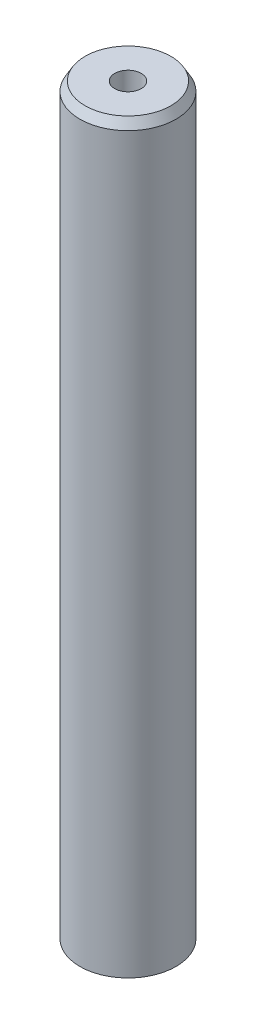
ISO-10303-21;
HEADER;
FILE_DESCRIPTION(('STEP AP214'),'2;1');
FILE_NAME('part.step','',(''),(''),'','','');
FILE_SCHEMA(('AUTOMOTIVE_DESIGN { 1 0 10303 214 1 1 1 1 }'));
ENDSEC;
DATA;
#1=APPLICATION_CONTEXT('core data for automotive mechanical design processes');
#2=APPLICATION_PROTOCOL_DEFINITION('international standard','automotive_design',2000,#1);
#3=PRODUCT_CONTEXT('',#1,'mechanical');
#4=PRODUCT('Part','Part','',(#3));
#5=PRODUCT_RELATED_PRODUCT_CATEGORY('part','',(#4));
#6=PRODUCT_DEFINITION_FORMATION('','',#4);
#7=PRODUCT_DEFINITION_CONTEXT('part definition',#1,'design');
#8=PRODUCT_DEFINITION('design','',#6,#7);
#9=PRODUCT_DEFINITION_SHAPE('','',#8);
#10=(LENGTH_UNIT() NAMED_UNIT(*) SI_UNIT(.MILLI.,.METRE.));
#11=(NAMED_UNIT(*) PLANE_ANGLE_UNIT() SI_UNIT($,.RADIAN.));
#12=(NAMED_UNIT(*) SI_UNIT($,.STERADIAN.) SOLID_ANGLE_UNIT());
#13=UNCERTAINTY_MEASURE_WITH_UNIT(LENGTH_MEASURE(1.E-05),#10,'distance_accuracy_value','');
#14=(GEOMETRIC_REPRESENTATION_CONTEXT(3) GLOBAL_UNCERTAINTY_ASSIGNED_CONTEXT((#13)) GLOBAL_UNIT_ASSIGNED_CONTEXT((#10,
#11,#12)) REPRESENTATION_CONTEXT('',''));
#15=CARTESIAN_POINT('',(0.,0.,0.));
#16=DIRECTION('',(0.,0.,1.));
#17=DIRECTION('',(1.,0.,0.));
#18=AXIS2_PLACEMENT_3D('',#15,#16,#17);
#19=CARTESIAN_POINT('',(0.,155.538059119569,0.));
#20=DIRECTION('',(0.,-1.,0.));
#21=DIRECTION('',(0.,0.,-1.));
#22=AXIS2_PLACEMENT_3D('',#19,#20,#21);
#23=CYLINDRICAL_SURFACE('',#22,10.);
#24=CARTESIAN_POINT('',(0.,153.660809936721,0.));
#25=DIRECTION('',(0.,1.,0.));
#26=DIRECTION('',(0.,0.,1.));
#27=AXIS2_PLACEMENT_3D('',#24,#25,#26);
#28=CIRCLE('',#27,10.);
#29=CARTESIAN_POINT('',(0.,153.660809936721,10.));
#30=VERTEX_POINT('',#29);
#31=EDGE_CURVE('E50',#30,#30,#28,.F.);
#32=ORIENTED_EDGE('',*,*,#31,.T.);
#33=EDGE_LOOP('',(#32));
#34=FACE_BOUND('',#33,.T.);
#35=CARTESIAN_POINT('',(0.,1.08383032105369,0.));
#36=DIRECTION('',(0.,1.,0.));
#37=DIRECTION('',(0.,0.,1.));
#38=AXIS2_PLACEMENT_3D('',#35,#36,#37);
#39=CIRCLE('',#38,10.);
#40=CARTESIAN_POINT('',(0.,1.08383032105369,10.));
#41=VERTEX_POINT('',#40);
#42=EDGE_CURVE('E51',#41,#41,#39,.T.);
#43=ORIENTED_EDGE('',*,*,#42,.T.);
#44=EDGE_LOOP('',(#43));
#45=FACE_BOUND('',#44,.T.);
#46=ADVANCED_FACE('F39',(#34,#45),#23,.T.);
#47=CARTESIAN_POINT('',(0.,155.538059119569,0.));
#48=DIRECTION('',(0.,1.,0.));
#49=DIRECTION('',(0.,0.,1.));
#50=AXIS2_PLACEMENT_3D('',#47,#48,#49);
#51=PLANE('',#50);
#52=CARTESIAN_POINT('',(0.,155.538059119569,0.));
#53=DIRECTION('',(0.,1.,0.));
#54=DIRECTION('',(0.,0.,1.));
#55=AXIS2_PLACEMENT_3D('',#52,#53,#54);
#56=CIRCLE('',#55,8.91616967894632);
#57=CARTESIAN_POINT('',(0.,155.538059119569,8.91616967894632));
#58=VERTEX_POINT('',#57);
#59=EDGE_CURVE('E54',#58,#58,#56,.T.);
#60=ORIENTED_EDGE('',*,*,#59,.T.);
#61=EDGE_LOOP('',(#60));
#62=FACE_BOUND('',#61,.T.);
#63=CARTESIAN_POINT('',(0.,155.538059119569,0.));
#64=DIRECTION('',(0.,1.,0.));
#65=DIRECTION('',(0.,0.,1.));
#66=AXIS2_PLACEMENT_3D('',#63,#64,#65);
#67=CIRCLE('',#66,2.75467316524421);
#68=CARTESIAN_POINT('',(0.,155.538059119569,2.75467316524421));
#69=VERTEX_POINT('',#68);
#70=EDGE_CURVE('E58',#69,#69,#67,.T.);
#71=ORIENTED_EDGE('',*,*,#70,.F.);
#72=EDGE_LOOP('',(#71));
#73=FACE_BOUND('',#72,.T.);
#74=ADVANCED_FACE('F69',(#62,#73),#51,.T.);
#75=CARTESIAN_POINT('',(0.,0.,0.));
#76=DIRECTION('',(0.,1.,0.));
#77=DIRECTION('',(0.,0.,1.));
#78=AXIS2_PLACEMENT_3D('',#75,#76,#77);
#79=PLANE('',#78);
#80=CARTESIAN_POINT('',(0.,0.,0.));
#81=DIRECTION('',(0.,1.,0.));
#82=DIRECTION('',(0.,0.,1.));
#83=AXIS2_PLACEMENT_3D('',#80,#81,#82);
#84=CIRCLE('',#83,8.12275081715133);
#85=CARTESIAN_POINT('',(0.,0.,8.12275081715133));
#86=VERTEX_POINT('',#85);
#87=EDGE_CURVE('E10',#86,#86,#84,.F.);
#88=ORIENTED_EDGE('',*,*,#87,.T.);
#89=EDGE_LOOP('',(#88));
#90=FACE_BOUND('',#89,.T.);
#91=CARTESIAN_POINT('',(0.,0.,0.));
#92=DIRECTION('',(0.,1.,0.));
#93=DIRECTION('',(0.,0.,1.));
#94=AXIS2_PLACEMENT_3D('',#91,#92,#93);
#95=CIRCLE('',#94,2.75467316524421);
#96=CARTESIAN_POINT('',(0.,0.,2.75467316524421));
#97=VERTEX_POINT('',#96);
#98=EDGE_CURVE('E63',#97,#97,#95,.T.);
#99=ORIENTED_EDGE('',*,*,#98,.T.);
#100=EDGE_LOOP('',(#99));
#101=FACE_BOUND('',#100,.T.);
#102=ADVANCED_FACE('F75',(#90,#101),#79,.F.);
#103=CARTESIAN_POINT('',(0.,155.538059119569,0.));
#104=DIRECTION('',(0.,-1.,0.));
#105=DIRECTION('',(0.,0.,-1.));
#106=AXIS2_PLACEMENT_3D('',#103,#104,#105);
#107=CYLINDRICAL_SURFACE('',#106,2.75467316524421);
#108=ORIENTED_EDGE('',*,*,#70,.T.);
#109=EDGE_LOOP('',(#108));
#110=FACE_BOUND('',#109,.T.);
#111=ORIENTED_EDGE('',*,*,#98,.F.);
#112=EDGE_LOOP('',(#111));
#113=FACE_BOUND('',#112,.T.);
#114=ADVANCED_FACE('F70',(#110,#113),#107,.F.);
#115=CARTESIAN_POINT('',(0.,155.538059119569,0.));
#116=DIRECTION('',(0.,-1.,0.));
#117=DIRECTION('',(0.,0.,-1.));
#118=AXIS2_PLACEMENT_3D('',#115,#116,#117);
#119=CONICAL_SURFACE('',#118,8.91616967894632,0.523598775598296);
#120=ORIENTED_EDGE('',*,*,#31,.F.);
#121=EDGE_LOOP('',(#120));
#122=FACE_BOUND('',#121,.T.);
#123=ORIENTED_EDGE('',*,*,#59,.F.);
#124=EDGE_LOOP('',(#123));
#125=FACE_BOUND('',#124,.T.);
#126=ADVANCED_FACE('F81',(#122,#125),#119,.T.);
#127=CARTESIAN_POINT('',(0.,1.08383032105369,0.));
#128=DIRECTION('',(0.,1.,0.));
#129=DIRECTION('',(0.,0.,1.));
#130=AXIS2_PLACEMENT_3D('',#127,#128,#129);
#131=CONICAL_SURFACE('',#130,10.,1.04719755119659);
#132=ORIENTED_EDGE('',*,*,#87,.F.);
#133=EDGE_LOOP('',(#132));
#134=FACE_BOUND('',#133,.T.);
#135=ORIENTED_EDGE('',*,*,#42,.F.);
#136=EDGE_LOOP('',(#135));
#137=FACE_BOUND('',#136,.T.);
#138=ADVANCED_FACE('F45',(#134,#137),#131,.T.);
#139=CLOSED_SHELL('',(#46,#74,#102,#114,#126,#138));
#140=MANIFOLD_SOLID_BREP('B2',#139);
#141=ADVANCED_BREP_SHAPE_REPRESENTATION('',(#18,#140),#14);
#142=SHAPE_DEFINITION_REPRESENTATION(#9,#141);
ENDSEC;
END-ISO-10303-21;
